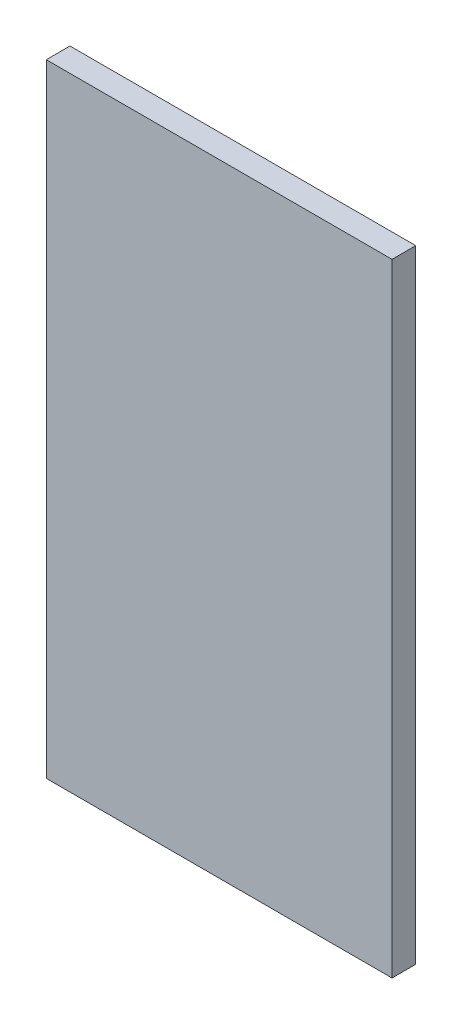
ISO-10303-21;
HEADER;
FILE_DESCRIPTION(('STEP AP214'),'2;1');
FILE_NAME('part.step','',(''),(''),'','','');
FILE_SCHEMA(('AUTOMOTIVE_DESIGN { 1 0 10303 214 1 1 1 1 }'));
ENDSEC;
DATA;
#1=APPLICATION_CONTEXT('core data for automotive mechanical design processes');
#2=APPLICATION_PROTOCOL_DEFINITION('international standard','automotive_design',2000,#1);
#3=PRODUCT_CONTEXT('',#1,'mechanical');
#4=PRODUCT('Part','Part','',(#3));
#5=PRODUCT_RELATED_PRODUCT_CATEGORY('part','',(#4));
#6=PRODUCT_DEFINITION_FORMATION('','',#4);
#7=PRODUCT_DEFINITION_CONTEXT('part definition',#1,'design');
#8=PRODUCT_DEFINITION('design','',#6,#7);
#9=PRODUCT_DEFINITION_SHAPE('','',#8);
#10=(LENGTH_UNIT() NAMED_UNIT(*) SI_UNIT(.MILLI.,.METRE.));
#11=(NAMED_UNIT(*) PLANE_ANGLE_UNIT() SI_UNIT($,.RADIAN.));
#12=(NAMED_UNIT(*) SI_UNIT($,.STERADIAN.) SOLID_ANGLE_UNIT());
#13=UNCERTAINTY_MEASURE_WITH_UNIT(LENGTH_MEASURE(1.E-05),#10,'distance_accuracy_value','');
#14=(GEOMETRIC_REPRESENTATION_CONTEXT(3) GLOBAL_UNCERTAINTY_ASSIGNED_CONTEXT((#13)) GLOBAL_UNIT_ASSIGNED_CONTEXT((#10,
#11,#12)) REPRESENTATION_CONTEXT('',''));
#15=CARTESIAN_POINT('',(0.,0.,0.));
#16=DIRECTION('',(0.,0.,1.));
#17=DIRECTION('',(1.,0.,0.));
#18=AXIS2_PLACEMENT_3D('',#15,#16,#17);
#19=CARTESIAN_POINT('',(10.60008,10.5,0.));
#20=DIRECTION('',(0.,0.,-1.));
#21=DIRECTION('',(-1.,0.,0.));
#22=AXIS2_PLACEMENT_3D('',#19,#20,#21);
#23=PLANE('',#22);
#24=DIRECTION('',(1.,0.,0.));
#25=VECTOR('',#24,1.);
#26=CARTESIAN_POINT('',(10.35008,10.95,0.));
#27=LINE('',#26,#25);
#28=CARTESIAN_POINT('',(10.35008,10.95,0.));
#29=VERTEX_POINT('',#28);
#30=CARTESIAN_POINT('',(10.85008,10.95,0.));
#31=VERTEX_POINT('',#30);
#32=EDGE_CURVE('E55',#29,#31,#27,.T.);
#33=ORIENTED_EDGE('',*,*,#32,.T.);
#34=DIRECTION('',(0.,1.,0.));
#35=VECTOR('',#34,1.);
#36=CARTESIAN_POINT('',(10.85008,10.95,0.));
#37=LINE('',#36,#35);
#38=CARTESIAN_POINT('',(10.85008,10.05,0.));
#39=VERTEX_POINT('',#38);
#40=EDGE_CURVE('E57',#31,#39,#37,.F.);
#41=ORIENTED_EDGE('',*,*,#40,.T.);
#42=DIRECTION('',(1.,0.,0.));
#43=VECTOR('',#42,1.);
#44=CARTESIAN_POINT('',(10.85008,10.05,0.));
#45=LINE('',#44,#43);
#46=CARTESIAN_POINT('',(10.35008,10.05,0.));
#47=VERTEX_POINT('',#46);
#48=EDGE_CURVE('E20',#39,#47,#45,.F.);
#49=ORIENTED_EDGE('',*,*,#48,.T.);
#50=DIRECTION('',(0.,1.,0.));
#51=VECTOR('',#50,1.);
#52=CARTESIAN_POINT('',(10.35008,10.05,0.));
#53=LINE('',#52,#51);
#54=EDGE_CURVE('E80',#47,#29,#53,.T.);
#55=ORIENTED_EDGE('',*,*,#54,.T.);
#56=EDGE_LOOP('',(#33,#41,#49,#55));
#57=FACE_BOUND('',#56,.T.);
#58=ADVANCED_FACE('F17',(#57),#23,.T.);
#59=CARTESIAN_POINT('',(10.85008,10.05,0.));
#60=DIRECTION('',(0.,1.,0.));
#61=DIRECTION('',(0.,0.,1.));
#62=AXIS2_PLACEMENT_3D('',#59,#60,#61);
#63=PLANE('',#62);
#64=DIRECTION('',(0.,0.,-1.));
#65=VECTOR('',#64,1.);
#66=CARTESIAN_POINT('',(10.35008,10.05,0.));
#67=LINE('',#66,#65);
#68=CARTESIAN_POINT('',(10.35008,10.05,0.03429));
#69=VERTEX_POINT('',#68);
#70=EDGE_CURVE('E68',#69,#47,#67,.T.);
#71=ORIENTED_EDGE('',*,*,#70,.T.);
#72=ORIENTED_EDGE('',*,*,#48,.F.);
#73=DIRECTION('',(0.,0.,1.));
#74=VECTOR('',#73,1.);
#75=CARTESIAN_POINT('',(10.85008,10.05,0.));
#76=LINE('',#75,#74);
#77=CARTESIAN_POINT('',(10.85008,10.05,0.03429));
#78=VERTEX_POINT('',#77);
#79=EDGE_CURVE('E63',#39,#78,#76,.T.);
#80=ORIENTED_EDGE('',*,*,#79,.T.);
#81=DIRECTION('',(1.,0.,0.));
#82=VECTOR('',#81,1.);
#83=CARTESIAN_POINT('',(10.60008,10.05,0.03429));
#84=LINE('',#83,#82);
#85=EDGE_CURVE('E83',#69,#78,#84,.T.);
#86=ORIENTED_EDGE('',*,*,#85,.F.);
#87=EDGE_LOOP('',(#71,#72,#80,#86));
#88=FACE_BOUND('',#87,.T.);
#89=ADVANCED_FACE('F65',(#88),#63,.F.);
#90=CARTESIAN_POINT('',(10.85008,10.95,0.));
#91=DIRECTION('',(-1.,0.,0.));
#92=DIRECTION('',(0.,0.,1.));
#93=AXIS2_PLACEMENT_3D('',#90,#91,#92);
#94=PLANE('',#93);
#95=ORIENTED_EDGE('',*,*,#79,.F.);
#96=ORIENTED_EDGE('',*,*,#40,.F.);
#97=DIRECTION('',(0.,0.,-1.));
#98=VECTOR('',#97,1.);
#99=CARTESIAN_POINT('',(10.85008,10.95,0.));
#100=LINE('',#99,#98);
#101=CARTESIAN_POINT('',(10.85008,10.95,0.03429));
#102=VERTEX_POINT('',#101);
#103=EDGE_CURVE('E75',#31,#102,#100,.F.);
#104=ORIENTED_EDGE('',*,*,#103,.T.);
#105=DIRECTION('',(0.,1.,0.));
#106=VECTOR('',#105,1.);
#107=CARTESIAN_POINT('',(10.85008,10.5,0.03429));
#108=LINE('',#107,#106);
#109=EDGE_CURVE('E72',#78,#102,#108,.T.);
#110=ORIENTED_EDGE('',*,*,#109,.F.);
#111=EDGE_LOOP('',(#95,#96,#104,#110));
#112=FACE_BOUND('',#111,.T.);
#113=ADVANCED_FACE('F70',(#112),#94,.F.);
#114=CARTESIAN_POINT('',(10.35008,10.95,0.));
#115=DIRECTION('',(0.,-1.,0.));
#116=DIRECTION('',(0.,0.,-1.));
#117=AXIS2_PLACEMENT_3D('',#114,#115,#116);
#118=PLANE('',#117);
#119=ORIENTED_EDGE('',*,*,#103,.F.);
#120=ORIENTED_EDGE('',*,*,#32,.F.);
#121=DIRECTION('',(0.,0.,-1.));
#122=VECTOR('',#121,1.);
#123=CARTESIAN_POINT('',(10.35008,10.95,0.));
#124=LINE('',#123,#122);
#125=CARTESIAN_POINT('',(10.35008,10.95,0.03429));
#126=VERTEX_POINT('',#125);
#127=EDGE_CURVE('E35',#29,#126,#124,.F.);
#128=ORIENTED_EDGE('',*,*,#127,.T.);
#129=DIRECTION('',(1.,0.,0.));
#130=VECTOR('',#129,1.);
#131=CARTESIAN_POINT('',(10.60008,10.95,0.03429));
#132=LINE('',#131,#130);
#133=EDGE_CURVE('E26',#102,#126,#132,.F.);
#134=ORIENTED_EDGE('',*,*,#133,.F.);
#135=EDGE_LOOP('',(#119,#120,#128,#134));
#136=FACE_BOUND('',#135,.T.);
#137=ADVANCED_FACE('F89',(#136),#118,.F.);
#138=CARTESIAN_POINT('',(10.35008,10.05,0.));
#139=DIRECTION('',(1.,0.,0.));
#140=DIRECTION('',(0.,0.,-1.));
#141=AXIS2_PLACEMENT_3D('',#138,#139,#140);
#142=PLANE('',#141);
#143=ORIENTED_EDGE('',*,*,#127,.F.);
#144=ORIENTED_EDGE('',*,*,#54,.F.);
#145=ORIENTED_EDGE('',*,*,#70,.F.);
#146=DIRECTION('',(0.,1.,0.));
#147=VECTOR('',#146,1.);
#148=CARTESIAN_POINT('',(10.35008,10.5,0.03429));
#149=LINE('',#148,#147);
#150=EDGE_CURVE('E11',#126,#69,#149,.F.);
#151=ORIENTED_EDGE('',*,*,#150,.F.);
#152=EDGE_LOOP('',(#143,#144,#145,#151));
#153=FACE_BOUND('',#152,.T.);
#154=ADVANCED_FACE('F91',(#153),#142,.F.);
#155=CARTESIAN_POINT('',(10.60008,10.5,0.03429));
#156=DIRECTION('',(0.,0.,1.));
#157=DIRECTION('',(1.,0.,0.));
#158=AXIS2_PLACEMENT_3D('',#155,#156,#157);
#159=PLANE('',#158);
#160=ORIENTED_EDGE('',*,*,#133,.T.);
#161=ORIENTED_EDGE('',*,*,#150,.T.);
#162=ORIENTED_EDGE('',*,*,#85,.T.);
#163=ORIENTED_EDGE('',*,*,#109,.T.);
#164=EDGE_LOOP('',(#160,#161,#162,#163));
#165=FACE_BOUND('',#164,.T.);
#166=ADVANCED_FACE('F88',(#165),#159,.T.);
#167=CLOSED_SHELL('',(#58,#89,#113,#137,#154,#166));
#168=MANIFOLD_SOLID_BREP('B1',#167);
#169=ADVANCED_BREP_SHAPE_REPRESENTATION('',(#18,#168),#14);
#170=SHAPE_DEFINITION_REPRESENTATION(#9,#169);
ENDSEC;
END-ISO-10303-21;
